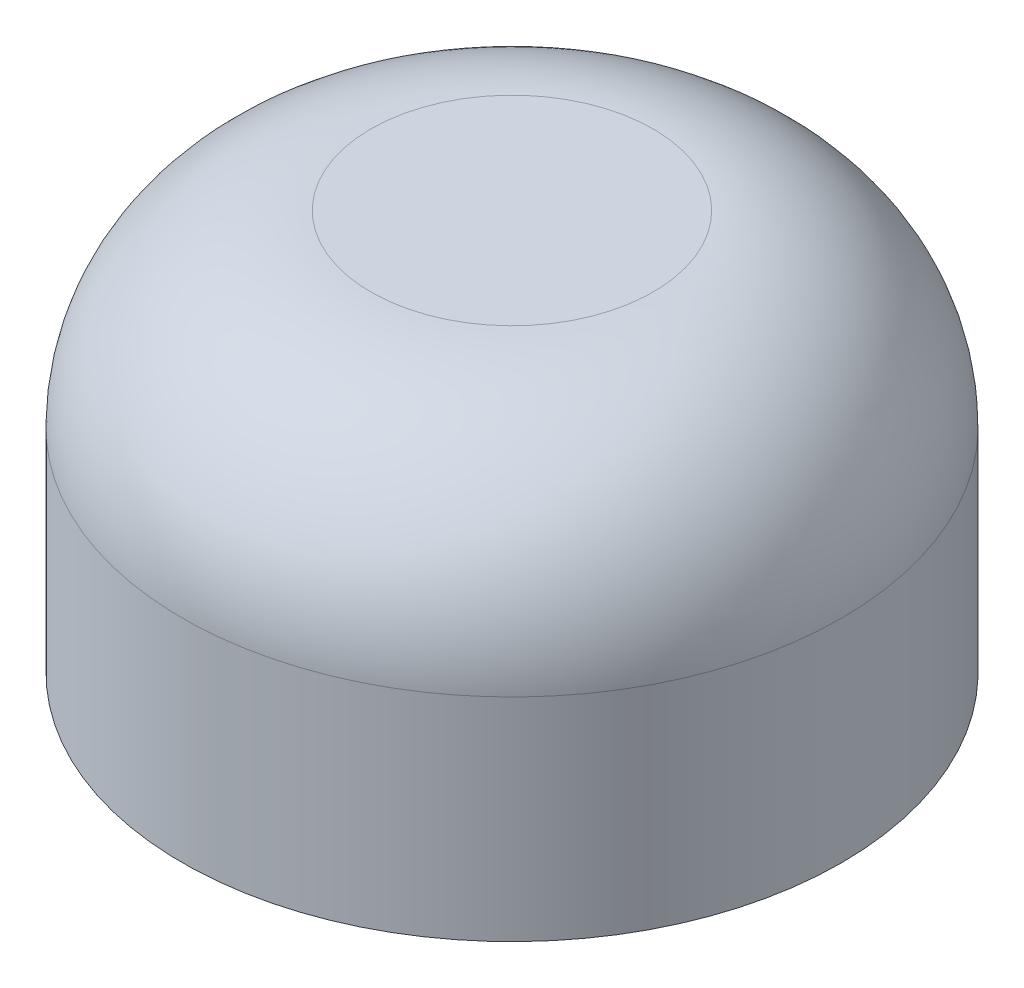
ISO-10303-21;
HEADER;
FILE_DESCRIPTION(('STEP AP214'),'2;1');
FILE_NAME('part.step','',(''),(''),'','','');
FILE_SCHEMA(('AUTOMOTIVE_DESIGN { 1 0 10303 214 1 1 1 1 }'));
ENDSEC;
DATA;
#1=APPLICATION_CONTEXT('core data for automotive mechanical design processes');
#2=APPLICATION_PROTOCOL_DEFINITION('international standard','automotive_design',2000,#1);
#3=PRODUCT_CONTEXT('',#1,'mechanical');
#4=PRODUCT('Part','Part','',(#3));
#5=PRODUCT_RELATED_PRODUCT_CATEGORY('part','',(#4));
#6=PRODUCT_DEFINITION_FORMATION('','',#4);
#7=PRODUCT_DEFINITION_CONTEXT('part definition',#1,'design');
#8=PRODUCT_DEFINITION('design','',#6,#7);
#9=PRODUCT_DEFINITION_SHAPE('','',#8);
#10=(LENGTH_UNIT() NAMED_UNIT(*) SI_UNIT(.MILLI.,.METRE.));
#11=(NAMED_UNIT(*) PLANE_ANGLE_UNIT() SI_UNIT($,.RADIAN.));
#12=(NAMED_UNIT(*) SI_UNIT($,.STERADIAN.) SOLID_ANGLE_UNIT());
#13=UNCERTAINTY_MEASURE_WITH_UNIT(LENGTH_MEASURE(1.E-05),#10,'distance_accuracy_value','');
#14=(GEOMETRIC_REPRESENTATION_CONTEXT(3) GLOBAL_UNCERTAINTY_ASSIGNED_CONTEXT((#13)) GLOBAL_UNIT_ASSIGNED_CONTEXT((#10,
#11,#12)) REPRESENTATION_CONTEXT('',''));
#15=CARTESIAN_POINT('',(0.,0.,0.));
#16=DIRECTION('',(0.,0.,1.));
#17=DIRECTION('',(1.,0.,0.));
#18=AXIS2_PLACEMENT_3D('',#15,#16,#17);
#19=CARTESIAN_POINT('',(0.,0.,0.));
#20=DIRECTION('',(0.,1.,0.));
#21=DIRECTION('',(-1.,0.,0.));
#22=AXIS2_PLACEMENT_3D('',#19,#20,#21);
#23=PLANE('',#22);
#24=CARTESIAN_POINT('',(0.,0.,0.));
#25=DIRECTION('',(0.,1.,0.));
#26=DIRECTION('',(-1.,0.,0.));
#27=AXIS2_PLACEMENT_3D('',#24,#25,#26);
#28=CIRCLE('',#27,1.5);
#29=CARTESIAN_POINT('',(-1.5,0.,0.));
#30=VERTEX_POINT('',#29);
#31=EDGE_CURVE('E10',#30,#30,#28,.T.);
#32=ORIENTED_EDGE('',*,*,#31,.F.);
#33=EDGE_LOOP('',(#32));
#34=FACE_BOUND('',#33,.T.);
#35=ADVANCED_FACE('F32',(#34),#23,.F.);
#36=CARTESIAN_POINT('',(0.,1.75,0.));
#37=DIRECTION('',(0.,1.,0.));
#38=DIRECTION('',(-1.,0.,0.));
#39=AXIS2_PLACEMENT_3D('',#36,#37,#38);
#40=CYLINDRICAL_SURFACE('',#39,1.5);
#41=CARTESIAN_POINT('',(0.,-2.5,0.));
#42=DIRECTION('',(0.,1.,0.));
#43=DIRECTION('',(-1.,0.,0.));
#44=AXIS2_PLACEMENT_3D('',#41,#42,#43);
#45=CIRCLE('',#44,1.5);
#46=CARTESIAN_POINT('',(-1.5,-2.5,0.));
#47=VERTEX_POINT('',#46);
#48=EDGE_CURVE('E38',#47,#47,#45,.T.);
#49=ORIENTED_EDGE('',*,*,#48,.F.);
#50=EDGE_LOOP('',(#49));
#51=FACE_BOUND('',#50,.T.);
#52=ORIENTED_EDGE('',*,*,#31,.T.);
#53=EDGE_LOOP('',(#52));
#54=FACE_BOUND('',#53,.T.);
#55=ADVANCED_FACE('F71',(#51,#54),#40,.F.);
#56=CARTESIAN_POINT('',(1.5,-2.5,0.));
#57=DIRECTION('',(0.,1.,0.));
#58=DIRECTION('',(-1.,0.,0.));
#59=AXIS2_PLACEMENT_3D('',#56,#57,#58);
#60=PLANE('',#59);
#61=CARTESIAN_POINT('',(0.,-2.5,0.));
#62=DIRECTION('',(0.,1.,0.));
#63=DIRECTION('',(-1.,0.,0.));
#64=AXIS2_PLACEMENT_3D('',#61,#62,#63);
#65=CIRCLE('',#64,3.5);
#66=CARTESIAN_POINT('',(-3.5,-2.5,0.));
#67=VERTEX_POINT('',#66);
#68=EDGE_CURVE('E42',#67,#67,#65,.T.);
#69=ORIENTED_EDGE('',*,*,#68,.F.);
#70=EDGE_LOOP('',(#69));
#71=FACE_BOUND('',#70,.T.);
#72=ORIENTED_EDGE('',*,*,#48,.T.);
#73=EDGE_LOOP('',(#72));
#74=FACE_BOUND('',#73,.T.);
#75=ADVANCED_FACE('F66',(#71,#74),#60,.F.);
#76=CARTESIAN_POINT('',(0.,1.75,0.));
#77=DIRECTION('',(0.,1.,0.));
#78=DIRECTION('',(-1.,0.,0.));
#79=AXIS2_PLACEMENT_3D('',#76,#77,#78);
#80=CYLINDRICAL_SURFACE('',#79,3.5);
#81=CARTESIAN_POINT('',(0.,-0.25,0.));
#82=DIRECTION('',(0.,1.,0.));
#83=DIRECTION('',(-1.,0.,0.));
#84=AXIS2_PLACEMENT_3D('',#81,#82,#83);
#85=CIRCLE('',#84,3.5);
#86=CARTESIAN_POINT('',(-3.5,-0.25,0.));
#87=VERTEX_POINT('',#86);
#88=EDGE_CURVE('E46',#87,#87,#85,.T.);
#89=ORIENTED_EDGE('',*,*,#88,.F.);
#90=EDGE_LOOP('',(#89));
#91=FACE_BOUND('',#90,.T.);
#92=ORIENTED_EDGE('',*,*,#68,.T.);
#93=EDGE_LOOP('',(#92));
#94=FACE_BOUND('',#93,.T.);
#95=ADVANCED_FACE('F60',(#91,#94),#80,.T.);
#96=CARTESIAN_POINT('',(0.,-0.25,0.));
#97=DIRECTION('',(0.,1.,0.));
#98=DIRECTION('',(-1.,0.,0.));
#99=AXIS2_PLACEMENT_3D('',#96,#97,#98);
#100=DEGENERATE_TOROIDAL_SURFACE('',#99,1.5,2.,.T.);
#101=CARTESIAN_POINT('',(0.,1.75,0.));
#102=DIRECTION('',(0.,1.,0.));
#103=DIRECTION('',(-1.,0.,0.));
#104=AXIS2_PLACEMENT_3D('',#101,#102,#103);
#105=CIRCLE('',#104,1.5);
#106=CARTESIAN_POINT('',(-1.5,1.75,0.));
#107=VERTEX_POINT('',#106);
#108=EDGE_CURVE('E51',#107,#107,#105,.T.);
#109=ORIENTED_EDGE('',*,*,#108,.F.);
#110=EDGE_LOOP('',(#109));
#111=FACE_BOUND('',#110,.T.);
#112=ORIENTED_EDGE('',*,*,#88,.T.);
#113=EDGE_LOOP('',(#112));
#114=FACE_BOUND('',#113,.T.);
#115=ADVANCED_FACE('F57',(#111,#114),#100,.T.);
#116=CARTESIAN_POINT('',(1.5,1.75,0.));
#117=DIRECTION('',(0.,-1.,0.));
#118=DIRECTION('',(1.,0.,0.));
#119=AXIS2_PLACEMENT_3D('',#116,#117,#118);
#120=PLANE('',#119);
#121=ORIENTED_EDGE('',*,*,#108,.T.);
#122=EDGE_LOOP('',(#121));
#123=FACE_BOUND('',#122,.T.);
#124=ADVANCED_FACE('F55',(#123),#120,.F.);
#125=CLOSED_SHELL('',(#35,#55,#75,#95,#115,#124));
#126=MANIFOLD_SOLID_BREP('B2',#125);
#127=ADVANCED_BREP_SHAPE_REPRESENTATION('',(#18,#126),#14);
#128=SHAPE_DEFINITION_REPRESENTATION(#9,#127);
ENDSEC;
END-ISO-10303-21;
